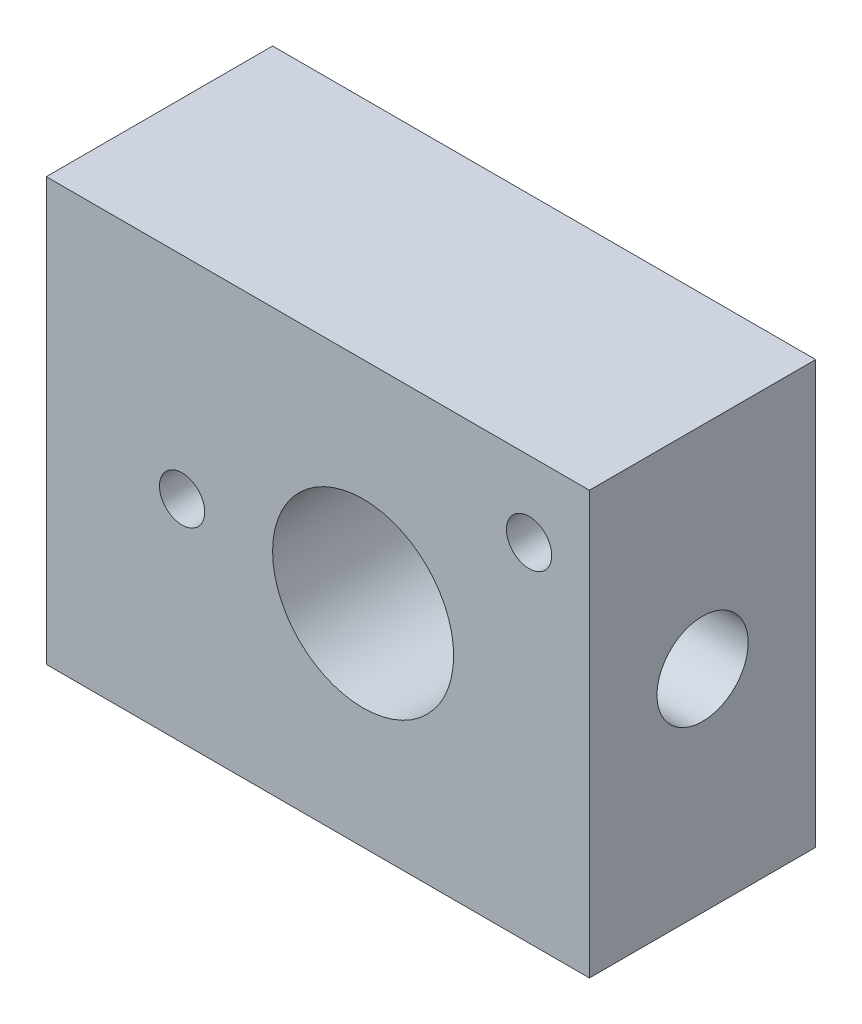
ISO-10303-21;
HEADER;
FILE_DESCRIPTION(('STEP AP214'),'2;1');
FILE_NAME('part.step','',(''),(''),'','','');
FILE_SCHEMA(('AUTOMOTIVE_DESIGN { 1 0 10303 214 1 1 1 1 }'));
ENDSEC;
DATA;
#1=APPLICATION_CONTEXT('core data for automotive mechanical design processes');
#2=APPLICATION_PROTOCOL_DEFINITION('international standard','automotive_design',2000,#1);
#3=PRODUCT_CONTEXT('',#1,'mechanical');
#4=PRODUCT('Part','Part','',(#3));
#5=PRODUCT_RELATED_PRODUCT_CATEGORY('part','',(#4));
#6=PRODUCT_DEFINITION_FORMATION('','',#4);
#7=PRODUCT_DEFINITION_CONTEXT('part definition',#1,'design');
#8=PRODUCT_DEFINITION('design','',#6,#7);
#9=PRODUCT_DEFINITION_SHAPE('','',#8);
#10=(LENGTH_UNIT() NAMED_UNIT(*) SI_UNIT(.MILLI.,.METRE.));
#11=(NAMED_UNIT(*) PLANE_ANGLE_UNIT() SI_UNIT($,.RADIAN.));
#12=(NAMED_UNIT(*) SI_UNIT($,.STERADIAN.) SOLID_ANGLE_UNIT());
#13=UNCERTAINTY_MEASURE_WITH_UNIT(LENGTH_MEASURE(1.E-05),#10,'distance_accuracy_value','');
#14=(GEOMETRIC_REPRESENTATION_CONTEXT(3) GLOBAL_UNCERTAINTY_ASSIGNED_CONTEXT((#13)) GLOBAL_UNIT_ASSIGNED_CONTEXT((#10,
#11,#12)) REPRESENTATION_CONTEXT('',''));
#15=CARTESIAN_POINT('',(0.,0.,0.));
#16=DIRECTION('',(0.,0.,1.));
#17=DIRECTION('',(1.,0.,0.));
#18=AXIS2_PLACEMENT_3D('',#15,#16,#17);
#19=CARTESIAN_POINT('',(18.,-14.,15.));
#20=DIRECTION('',(-1.,0.,0.));
#21=DIRECTION('',(0.,0.,1.));
#22=AXIS2_PLACEMENT_3D('',#19,#20,#21);
#23=PLANE('',#22);
#24=CARTESIAN_POINT('',(18.,0.,7.5));
#25=DIRECTION('',(1.,0.,0.));
#26=DIRECTION('',(0.,0.,-1.));
#27=AXIS2_PLACEMENT_3D('',#24,#25,#26);
#28=CIRCLE('',#27,3.02209714317602);
#29=CARTESIAN_POINT('',(18.,0.,4.47790285682398));
#30=VERTEX_POINT('',#29);
#31=EDGE_CURVE('E134',#30,#30,#28,.T.);
#32=ORIENTED_EDGE('',*,*,#31,.F.);
#33=EDGE_LOOP('',(#32));
#34=FACE_BOUND('',#33,.T.);
#35=DIRECTION('',(0.,1.,0.));
#36=VECTOR('',#35,1.);
#37=CARTESIAN_POINT('',(18.,-14.,0.));
#38=LINE('',#37,#36);
#39=CARTESIAN_POINT('',(18.,-14.,0.));
#40=VERTEX_POINT('',#39);
#41=CARTESIAN_POINT('',(18.,14.,0.));
#42=VERTEX_POINT('',#41);
#43=EDGE_CURVE('E96',#40,#42,#38,.T.);
#44=ORIENTED_EDGE('',*,*,#43,.T.);
#45=DIRECTION('',(0.,0.,-1.));
#46=VECTOR('',#45,1.);
#47=CARTESIAN_POINT('',(18.,14.,15.));
#48=LINE('',#47,#46);
#49=CARTESIAN_POINT('',(18.,14.,15.));
#50=VERTEX_POINT('',#49);
#51=EDGE_CURVE('E11',#50,#42,#48,.T.);
#52=ORIENTED_EDGE('',*,*,#51,.F.);
#53=DIRECTION('',(0.,1.,0.));
#54=VECTOR('',#53,1.);
#55=CARTESIAN_POINT('',(18.,-14.,15.));
#56=LINE('',#55,#54);
#57=CARTESIAN_POINT('',(18.,-14.,15.));
#58=VERTEX_POINT('',#57);
#59=EDGE_CURVE('E84',#58,#50,#56,.T.);
#60=ORIENTED_EDGE('',*,*,#59,.F.);
#61=DIRECTION('',(0.,0.,-1.));
#62=VECTOR('',#61,1.);
#63=CARTESIAN_POINT('',(18.,-14.,15.));
#64=LINE('',#63,#62);
#65=EDGE_CURVE('E92',#58,#40,#64,.T.);
#66=ORIENTED_EDGE('',*,*,#65,.T.);
#67=EDGE_LOOP('',(#44,#52,#60,#66));
#68=FACE_BOUND('',#67,.T.);
#69=ADVANCED_FACE('F33',(#34,#68),#23,.F.);
#70=CARTESIAN_POINT('',(-18.,14.,15.));
#71=DIRECTION('',(0.,-1.,0.));
#72=DIRECTION('',(0.,0.,-1.));
#73=AXIS2_PLACEMENT_3D('',#70,#71,#72);
#74=PLANE('',#73);
#75=DIRECTION('',(-1.,0.,0.));
#76=VECTOR('',#75,1.);
#77=CARTESIAN_POINT('',(-18.,14.,0.));
#78=LINE('',#77,#76);
#79=CARTESIAN_POINT('',(-18.,14.,0.));
#80=VERTEX_POINT('',#79);
#81=EDGE_CURVE('E88',#42,#80,#78,.T.);
#82=ORIENTED_EDGE('',*,*,#81,.T.);
#83=DIRECTION('',(0.,0.,-1.));
#84=VECTOR('',#83,1.);
#85=CARTESIAN_POINT('',(-18.,14.,15.));
#86=LINE('',#85,#84);
#87=CARTESIAN_POINT('',(-18.,14.,15.));
#88=VERTEX_POINT('',#87);
#89=EDGE_CURVE('E41',#88,#80,#86,.T.);
#90=ORIENTED_EDGE('',*,*,#89,.F.);
#91=DIRECTION('',(-1.,0.,0.));
#92=VECTOR('',#91,1.);
#93=CARTESIAN_POINT('',(-18.,14.,15.));
#94=LINE('',#93,#92);
#95=EDGE_CURVE('E79',#50,#88,#94,.T.);
#96=ORIENTED_EDGE('',*,*,#95,.F.);
#97=ORIENTED_EDGE('',*,*,#51,.T.);
#98=EDGE_LOOP('',(#82,#90,#96,#97));
#99=FACE_BOUND('',#98,.T.);
#100=ADVANCED_FACE('F87',(#99),#74,.F.);
#101=CARTESIAN_POINT('',(-18.,-14.,15.));
#102=DIRECTION('',(1.,0.,0.));
#103=DIRECTION('',(0.,0.,-1.));
#104=AXIS2_PLACEMENT_3D('',#101,#102,#103);
#105=PLANE('',#104);
#106=DIRECTION('',(0.,-1.,0.));
#107=VECTOR('',#106,1.);
#108=CARTESIAN_POINT('',(-18.,-14.,0.));
#109=LINE('',#108,#107);
#110=CARTESIAN_POINT('',(-18.,-14.,0.));
#111=VERTEX_POINT('',#110);
#112=EDGE_CURVE('E66',#80,#111,#109,.T.);
#113=ORIENTED_EDGE('',*,*,#112,.T.);
#114=DIRECTION('',(0.,0.,-1.));
#115=VECTOR('',#114,1.);
#116=CARTESIAN_POINT('',(-18.,-14.,15.));
#117=LINE('',#116,#115);
#118=CARTESIAN_POINT('',(-18.,-14.,15.));
#119=VERTEX_POINT('',#118);
#120=EDGE_CURVE('E89',#119,#111,#117,.T.);
#121=ORIENTED_EDGE('',*,*,#120,.F.);
#122=DIRECTION('',(0.,-1.,0.));
#123=VECTOR('',#122,1.);
#124=CARTESIAN_POINT('',(-18.,-14.,15.));
#125=LINE('',#124,#123);
#126=EDGE_CURVE('E82',#88,#119,#125,.T.);
#127=ORIENTED_EDGE('',*,*,#126,.F.);
#128=ORIENTED_EDGE('',*,*,#89,.T.);
#129=EDGE_LOOP('',(#113,#121,#127,#128));
#130=FACE_BOUND('',#129,.T.);
#131=ADVANCED_FACE('F90',(#130),#105,.F.);
#132=CARTESIAN_POINT('',(-18.,-14.,15.));
#133=DIRECTION('',(0.,1.,0.));
#134=DIRECTION('',(0.,0.,1.));
#135=AXIS2_PLACEMENT_3D('',#132,#133,#134);
#136=PLANE('',#135);
#137=DIRECTION('',(1.,0.,0.));
#138=VECTOR('',#137,1.);
#139=CARTESIAN_POINT('',(-18.,-14.,0.));
#140=LINE('',#139,#138);
#141=EDGE_CURVE('E72',#111,#40,#140,.T.);
#142=ORIENTED_EDGE('',*,*,#141,.T.);
#143=ORIENTED_EDGE('',*,*,#65,.F.);
#144=DIRECTION('',(1.,0.,0.));
#145=VECTOR('',#144,1.);
#146=CARTESIAN_POINT('',(-18.,-14.,15.));
#147=LINE('',#146,#145);
#148=EDGE_CURVE('E49',#119,#58,#147,.T.);
#149=ORIENTED_EDGE('',*,*,#148,.F.);
#150=ORIENTED_EDGE('',*,*,#120,.T.);
#151=EDGE_LOOP('',(#142,#143,#149,#150));
#152=FACE_BOUND('',#151,.T.);
#153=ADVANCED_FACE('F104',(#152),#136,.F.);
#154=CARTESIAN_POINT('',(0.,0.,15.));
#155=DIRECTION('',(0.,0.,-1.));
#156=DIRECTION('',(-1.,0.,0.));
#157=AXIS2_PLACEMENT_3D('',#154,#155,#156);
#158=PLANE('',#157);
#159=CARTESIAN_POINT('',(14.,8.99999999999999,15.));
#160=DIRECTION('',(0.,0.,1.));
#161=DIRECTION('',(1.,0.,0.));
#162=AXIS2_PLACEMENT_3D('',#159,#160,#161);
#163=CIRCLE('',#162,1.5);
#164=CARTESIAN_POINT('',(15.5,8.99999999999999,15.));
#165=VERTEX_POINT('',#164);
#166=EDGE_CURVE('E116',#165,#165,#163,.T.);
#167=ORIENTED_EDGE('',*,*,#166,.F.);
#168=EDGE_LOOP('',(#167));
#169=FACE_BOUND('',#168,.T.);
#170=CARTESIAN_POINT('',(-9.,0.,15.));
#171=DIRECTION('',(0.,0.,1.));
#172=DIRECTION('',(1.,0.,0.));
#173=AXIS2_PLACEMENT_3D('',#170,#171,#172);
#174=CIRCLE('',#173,1.5);
#175=CARTESIAN_POINT('',(-7.5,0.,15.));
#176=VERTEX_POINT('',#175);
#177=EDGE_CURVE('E123',#176,#176,#174,.T.);
#178=ORIENTED_EDGE('',*,*,#177,.F.);
#179=EDGE_LOOP('',(#178));
#180=FACE_BOUND('',#179,.T.);
#181=CARTESIAN_POINT('',(3.,0.,15.));
#182=DIRECTION('',(0.,0.,1.));
#183=DIRECTION('',(1.,0.,0.));
#184=AXIS2_PLACEMENT_3D('',#181,#182,#183);
#185=CIRCLE('',#184,6.);
#186=CARTESIAN_POINT('',(9.,0.,15.));
#187=VERTEX_POINT('',#186);
#188=EDGE_CURVE('E110',#187,#187,#185,.T.);
#189=ORIENTED_EDGE('',*,*,#188,.F.);
#190=EDGE_LOOP('',(#189));
#191=FACE_BOUND('',#190,.T.);
#192=ORIENTED_EDGE('',*,*,#59,.T.);
#193=ORIENTED_EDGE('',*,*,#95,.T.);
#194=ORIENTED_EDGE('',*,*,#126,.T.);
#195=ORIENTED_EDGE('',*,*,#148,.T.);
#196=EDGE_LOOP('',(#192,#193,#194,#195));
#197=FACE_BOUND('',#196,.T.);
#198=ADVANCED_FACE('F80',(#169,#180,#191,#197),#158,.F.);
#199=CARTESIAN_POINT('',(0.,0.,0.));
#200=DIRECTION('',(0.,0.,-1.));
#201=DIRECTION('',(-1.,0.,0.));
#202=AXIS2_PLACEMENT_3D('',#199,#200,#201);
#203=PLANE('',#202);
#204=CARTESIAN_POINT('',(14.,8.99999999999999,0.));
#205=DIRECTION('',(0.,0.,1.));
#206=DIRECTION('',(1.,0.,0.));
#207=AXIS2_PLACEMENT_3D('',#204,#205,#206);
#208=CIRCLE('',#207,1.5);
#209=CARTESIAN_POINT('',(15.5,8.99999999999999,0.));
#210=VERTEX_POINT('',#209);
#211=EDGE_CURVE('E119',#210,#210,#208,.T.);
#212=ORIENTED_EDGE('',*,*,#211,.T.);
#213=EDGE_LOOP('',(#212));
#214=FACE_BOUND('',#213,.T.);
#215=CARTESIAN_POINT('',(-9.,0.,0.));
#216=DIRECTION('',(0.,0.,1.));
#217=DIRECTION('',(1.,0.,0.));
#218=AXIS2_PLACEMENT_3D('',#215,#216,#217);
#219=CIRCLE('',#218,1.5);
#220=CARTESIAN_POINT('',(-7.5,0.,0.));
#221=VERTEX_POINT('',#220);
#222=EDGE_CURVE('E113',#221,#221,#219,.T.);
#223=ORIENTED_EDGE('',*,*,#222,.T.);
#224=EDGE_LOOP('',(#223));
#225=FACE_BOUND('',#224,.T.);
#226=CARTESIAN_POINT('',(3.,0.,0.));
#227=DIRECTION('',(0.,0.,1.));
#228=DIRECTION('',(1.,0.,0.));
#229=AXIS2_PLACEMENT_3D('',#226,#227,#228);
#230=CIRCLE('',#229,6.);
#231=CARTESIAN_POINT('',(9.,0.,0.));
#232=VERTEX_POINT('',#231);
#233=EDGE_CURVE('E99',#232,#232,#230,.T.);
#234=ORIENTED_EDGE('',*,*,#233,.T.);
#235=EDGE_LOOP('',(#234));
#236=FACE_BOUND('',#235,.T.);
#237=ORIENTED_EDGE('',*,*,#43,.F.);
#238=ORIENTED_EDGE('',*,*,#141,.F.);
#239=ORIENTED_EDGE('',*,*,#112,.F.);
#240=ORIENTED_EDGE('',*,*,#81,.F.);
#241=EDGE_LOOP('',(#237,#238,#239,#240));
#242=FACE_BOUND('',#241,.T.);
#243=ADVANCED_FACE('F107',(#214,#225,#236,#242),#203,.T.);
#244=CARTESIAN_POINT('',(3.,0.,0.));
#245=DIRECTION('',(0.,0.,1.));
#246=DIRECTION('',(1.,0.,0.));
#247=AXIS2_PLACEMENT_3D('',#244,#245,#246);
#248=CYLINDRICAL_SURFACE('',#247,6.);
#249=CARTESIAN_POINT('',(9.,0.,4.47790285682398));
#250=CARTESIAN_POINT('',(8.99999937921445,-0.0794046724287873,4.47790366065204));
#251=CARTESIAN_POINT('',(8.99841845831467,-0.158816634390565,4.48103815245036));
#252=CARTESIAN_POINT('',(8.99214299911639,-0.317036234976484,4.49352836687739));
#253=CARTESIAN_POINT('',(8.98744708983378,-0.395843592042891,4.50288682883535));
#254=CARTESIAN_POINT('',(8.96882103212114,-0.630664468139933,4.54020177521699));
#255=CARTESIAN_POINT('',(8.95035277545312,-0.784967937649012,4.57739764229085));
#256=CARTESIAN_POINT('',(8.90325131094213,-1.08374012762707,4.67454054356725));
#257=CARTESIAN_POINT('',(8.87465782713843,-1.2282446890037,4.73439872986898));
#258=CARTESIAN_POINT('',(8.80992710672065,-1.5049722663237,4.8747006361027));
#259=CARTESIAN_POINT('',(8.77379039282066,-1.63719613235066,4.95514292972992));
#260=CARTESIAN_POINT('',(8.69468980056808,-1.8946627387539,5.13992625744918));
#261=CARTESIAN_POINT('',(8.65144362350557,-2.01898468972008,5.24542757538857));
#262=CARTESIAN_POINT('',(8.56391178078829,-2.24901287340156,5.47479656086422));
#263=CARTESIAN_POINT('',(8.51962534017722,-2.3547046946163,5.5986783115067));
#264=CARTESIAN_POINT('',(8.43096829647197,-2.55289842829413,5.87316763508968));
#265=CARTESIAN_POINT('',(8.38686739636691,-2.64369888760894,6.0251133607497));
#266=CARTESIAN_POINT('',(8.32798336925892,-2.75943322803995,6.2644907480865));
#267=CARTESIAN_POINT('',(8.30956161683313,-2.79460865390371,6.34622238056033));
#268=CARTESIAN_POINT('',(8.2758322726724,-2.85777457856287,6.51301878637586));
#269=CARTESIAN_POINT('',(8.26052283027051,-2.88576934978467,6.59808154283418));
#270=CARTESIAN_POINT('',(8.23446375198618,-2.93275788426132,6.76574801075304));
#271=CARTESIAN_POINT('',(8.22349650760129,-2.95218913297542,6.84819549028909));
#272=CARTESIAN_POINT('',(8.20533388079787,-2.98409731014551,7.01479622482199));
#273=CARTESIAN_POINT('',(8.19813648298742,-2.99657795467959,7.09894854335139));
#274=CARTESIAN_POINT('',(8.18782539255426,-3.01439500443863,7.26820971958591));
#275=CARTESIAN_POINT('',(8.18470915386116,-3.01973586393039,7.35331794747673));
#276=CARTESIAN_POINT('',(8.18268392729822,-3.02320718628004,7.52370294559238));
#277=CARTESIAN_POINT('',(8.1837745273331,-3.02133835538782,7.60897969849084));
#278=CARTESIAN_POINT('',(8.19254992593765,-3.00626219856147,7.84311847016495));
#279=CARTESIAN_POINT('',(8.20458864135882,-2.98556481157974,7.99141741635277));
#280=CARTESIAN_POINT('',(8.23998953687164,-2.92297025624911,8.28196310985437));
#281=CARTESIAN_POINT('',(8.26335541457105,-2.88106616504547,8.42420786434898));
#282=CARTESIAN_POINT('',(8.31926444665351,-2.77650909994461,8.70279432583057));
#283=CARTESIAN_POINT('',(8.35200841328761,-2.71339620065964,8.83892178448155));
#284=CARTESIAN_POINT('',(8.42300399097646,-2.56856438989169,9.09930504776544));
#285=CARTESIAN_POINT('',(8.46125807482797,-2.4868371151401,9.22355548042628));
#286=CARTESIAN_POINT('',(8.54492021216669,-2.29481485446292,9.47353137296015));
#287=CARTESIAN_POINT('',(8.5906147458075,-2.18219522127572,9.59738176213365));
#288=CARTESIAN_POINT('',(8.68001837207146,-1.93761413603706,9.82522555050324));
#289=CARTESIAN_POINT('',(8.72372648081246,-1.80564323311,9.92920918959694));
#290=CARTESIAN_POINT('',(8.80677970478424,-1.51813060892959,10.1190453666692));
#291=CARTESIAN_POINT('',(8.84581667049427,-1.36176407834326,10.2037945315672));
#292=CARTESIAN_POINT('',(8.91248990963943,-1.03453025048335,10.3450844690112));
#293=CARTESIAN_POINT('',(8.94013535770922,-0.863674756770077,10.4016479497912));
#294=CARTESIAN_POINT('',(8.97894518335837,-0.527631875615529,10.4802544600782));
#295=CARTESIAN_POINT('',(8.99129457685662,-0.363165531289766,10.5047889487964));
#296=CARTESIAN_POINT('',(9.00219679390133,-0.0320113750543197,10.5264729272789));
#297=CARTESIAN_POINT('',(9.00075629884769,0.134675321971515,10.5236356790395));
#298=CARTESIAN_POINT('',(8.98492284778046,0.451546188515737,10.492076592989));
#299=CARTESIAN_POINT('',(8.97156092377412,0.601994661896129,10.4654149424294));
#300=CARTESIAN_POINT('',(8.93457589510384,0.89597264544466,10.3902129930908));
#301=CARTESIAN_POINT('',(8.91095166662322,1.0395013959265,10.3416702981144));
#302=CARTESIAN_POINT('',(8.85473910598521,1.32027350668948,10.2228391840966));
#303=CARTESIAN_POINT('',(8.82191624067774,1.45722447512577,10.1519748127601));
#304=CARTESIAN_POINT('',(8.75044773940395,1.71773882191692,9.99116553673079));
#305=CARTESIAN_POINT('',(8.71179964191823,1.84129650265603,9.90121255934027));
#306=CARTESIAN_POINT('',(8.62786591956175,2.08453234781852,9.69447892660516));
#307=CARTESIAN_POINT('',(8.58230227789292,2.20260692351342,9.57592125902128));
#308=CARTESIAN_POINT('',(8.49247674046022,2.41792007371871,9.32061757272204));
#309=CARTESIAN_POINT('',(8.44821579768555,2.51514370629798,9.18385862381876));
#310=CARTESIAN_POINT('',(8.36381581830725,2.69062202067928,8.8873556931103));
#311=CARTESIAN_POINT('',(8.32399678373696,2.76767428000612,8.72680083959058));
#312=CARTESIAN_POINT('',(8.257050305852,2.89284179927778,8.39235996665706));
#313=CARTESIAN_POINT('',(8.22990628936297,2.94099486990001,8.2184917035585));
#314=CARTESIAN_POINT('',(8.19481050542114,3.00251335139144,7.88027918122801));
#315=CARTESIAN_POINT('',(8.18526042609616,3.01878558885158,7.71663329369105));
#316=CARTESIAN_POINT('',(8.1819388052022,3.02449001974523,7.38874469274403));
#317=CARTESIAN_POINT('',(8.18816007898197,3.01393443460701,7.22450228511821));
#318=CARTESIAN_POINT('',(8.21397395893243,2.96901024736537,6.91706728316952));
#319=CARTESIAN_POINT('',(8.23219674040541,2.93707613801478,6.77338895076863));
#320=CARTESIAN_POINT('',(8.27832418681672,2.85334265776916,6.49359785016695));
#321=CARTESIAN_POINT('',(8.3062320034986,2.80153681955668,6.35748756153936));
#322=CARTESIAN_POINT('',(8.37086631357498,2.67565132046183,6.08658005152428));
#323=CARTESIAN_POINT('',(8.40805880624842,2.60031058330526,5.95248344683451));
#324=CARTESIAN_POINT('',(8.48631080897633,2.43086330337949,5.69795331132392));
#325=CARTESIAN_POINT('',(8.52737234020161,2.33674692328536,5.57752699504108));
#326=CARTESIAN_POINT('',(8.61482339509894,2.11877337616414,5.33823719758819));
#327=CARTESIAN_POINT('',(8.66124236592629,1.99267566729959,5.22141828833886));
#328=CARTESIAN_POINT('',(8.74955582222863,1.72130934015263,5.01008091176717));
#329=CARTESIAN_POINT('',(8.79144781807337,1.57603026958559,4.91557468189572));
#330=CARTESIAN_POINT('',(8.84768964620757,1.34569539566253,4.79262636600014));
#331=CARTESIAN_POINT('',(8.8654084571169,1.2664249153869,4.75463853494308));
#332=CARTESIAN_POINT('',(8.89806000835203,1.10439976794239,4.68555257407274));
#333=CARTESIAN_POINT('',(8.91299411518349,1.02164683424376,4.6544510636031));
#334=CARTESIAN_POINT('',(8.93960169941801,0.853445822798342,4.59956667728931));
#335=CARTESIAN_POINT('',(8.95128223019568,0.768004029211911,4.57576795826883));
#336=CARTESIAN_POINT('',(8.97105866915571,0.595002753395696,4.5357265361172));
#337=CARTESIAN_POINT('',(8.97915674557358,0.507444586014155,4.51947926226635));
#338=CARTESIAN_POINT('',(8.99019178193422,0.349907450581672,4.49741157887818));
#339=CARTESIAN_POINT('',(8.99386302291791,0.280184141034869,4.49010252493424));
#340=CARTESIAN_POINT('',(8.99876743969866,0.140309125657505,4.48034774196969));
#341=CARTESIAN_POINT('',(9.00000054849046,0.0701574081064868,4.47790214660767));
#342=CARTESIAN_POINT('',(9.,0.,4.47790285682398));
#343=B_SPLINE_CURVE_WITH_KNOTS('',3,(#249,#250,#251,#252,#253,#254,#255,#256,#257,#258,#259,
#260,#261,#262,#263,#264,#265,#266,#267,#268,#269,#270,#271,#272,#273,#274,#275,#276,#277,#278,
#279,#280,#281,#282,#283,#284,#285,#286,#287,#288,#289,#290,#291,#292,#293,#294,#295,#296,#297,
#298,#299,#300,#301,#302,#303,#304,#305,#306,#307,#308,#309,#310,#311,#312,#313,#314,#315,#316,
#317,#318,#319,#320,#321,#322,#323,#324,#325,#326,#327,#328,#329,#330,#331,#332,#333,#334,#335,
#336,#337,#338,#339,#340,#341,#342),.UNSPECIFIED.,.T.,.F.,(4,2,2,2,2,2,2,2,2,2,2,2,2,2,2,2,2,2,
2,2,2,2,2,2,2,2,2,2,2,2,2,2,2,2,2,2,2,2,2,2,2,2,2,2,2,2,4),(0.,0.238140571816825,
0.47638602484399,0.953199032854076,1.42816172885239,1.90309152285547,2.40705231606408,
2.91140125788193,3.45559085867578,3.72786857118795,3.99998390308314,4.25585870211716,
4.51159656833382,4.76717481390124,5.02272802406283,5.47106722300219,5.91955287521184,
6.37846977041511,6.83759326094064,7.35590910747355,7.87447894020782,8.41782016158569,
8.96072292103289,9.45822017604467,9.95547639866531,10.4134947494174,10.8715632700395,
11.3425812829453,11.8137988908843,12.3318086308606,12.8501883489641,13.3946840213432,
13.9384657328898,14.4298102396129,14.920930954219,15.3639324414043,15.8070782273306,
16.2799519778019,16.7530741399068,17.2848499803415,17.8169168006975,18.0856179525571,
18.3541868987901,18.6221690052264,18.8899886962136,19.1003902461146,19.3107975782353),.UNSPECIFIED.);
#344=CARTESIAN_POINT('',(9.,0.,4.47790285682398));
#345=VERTEX_POINT('',#344);
#346=EDGE_CURVE('E120',#345,#345,#343,.T.);
#347=ORIENTED_EDGE('',*,*,#346,.F.);
#348=EDGE_LOOP('',(#347));
#349=FACE_BOUND('',#348,.T.);
#350=ORIENTED_EDGE('',*,*,#233,.F.);
#351=EDGE_LOOP('',(#350));
#352=FACE_BOUND('',#351,.T.);
#353=ORIENTED_EDGE('',*,*,#188,.T.);
#354=EDGE_LOOP('',(#353));
#355=FACE_BOUND('',#354,.T.);
#356=ADVANCED_FACE('F145',(#349,#352,#355),#248,.F.);
#357=CARTESIAN_POINT('',(-9.,0.,0.));
#358=DIRECTION('',(0.,0.,1.));
#359=DIRECTION('',(1.,0.,0.));
#360=AXIS2_PLACEMENT_3D('',#357,#358,#359);
#361=CYLINDRICAL_SURFACE('',#360,1.5);
#362=ORIENTED_EDGE('',*,*,#222,.F.);
#363=EDGE_LOOP('',(#362));
#364=FACE_BOUND('',#363,.T.);
#365=ORIENTED_EDGE('',*,*,#177,.T.);
#366=EDGE_LOOP('',(#365));
#367=FACE_BOUND('',#366,.T.);
#368=ADVANCED_FACE('F142',(#364,#367),#361,.F.);
#369=CARTESIAN_POINT('',(14.,8.99999999999999,0.));
#370=DIRECTION('',(0.,0.,1.));
#371=DIRECTION('',(1.,0.,0.));
#372=AXIS2_PLACEMENT_3D('',#369,#370,#371);
#373=CYLINDRICAL_SURFACE('',#372,1.5);
#374=ORIENTED_EDGE('',*,*,#211,.F.);
#375=EDGE_LOOP('',(#374));
#376=FACE_BOUND('',#375,.T.);
#377=ORIENTED_EDGE('',*,*,#166,.T.);
#378=EDGE_LOOP('',(#377));
#379=FACE_BOUND('',#378,.T.);
#380=ADVANCED_FACE('F140',(#376,#379),#373,.F.);
#381=CARTESIAN_POINT('',(-18.001,0.,7.5));
#382=DIRECTION('',(1.,0.,0.));
#383=DIRECTION('',(0.,0.,-1.));
#384=AXIS2_PLACEMENT_3D('',#381,#382,#383);
#385=CYLINDRICAL_SURFACE('',#384,3.02209714317602);
#386=ORIENTED_EDGE('',*,*,#31,.T.);
#387=EDGE_LOOP('',(#386));
#388=FACE_BOUND('',#387,.T.);
#389=ORIENTED_EDGE('',*,*,#346,.T.);
#390=EDGE_LOOP('',(#389));
#391=FACE_BOUND('',#390,.T.);
#392=ADVANCED_FACE('F135',(#388,#391),#385,.F.);
#393=CLOSED_SHELL('',(#69,#100,#131,#153,#198,#243,#356,#368,#380,#392));
#394=MANIFOLD_SOLID_BREP('B2',#393);
#395=ADVANCED_BREP_SHAPE_REPRESENTATION('',(#18,#394),#14);
#396=SHAPE_DEFINITION_REPRESENTATION(#9,#395);
ENDSEC;
END-ISO-10303-21;
